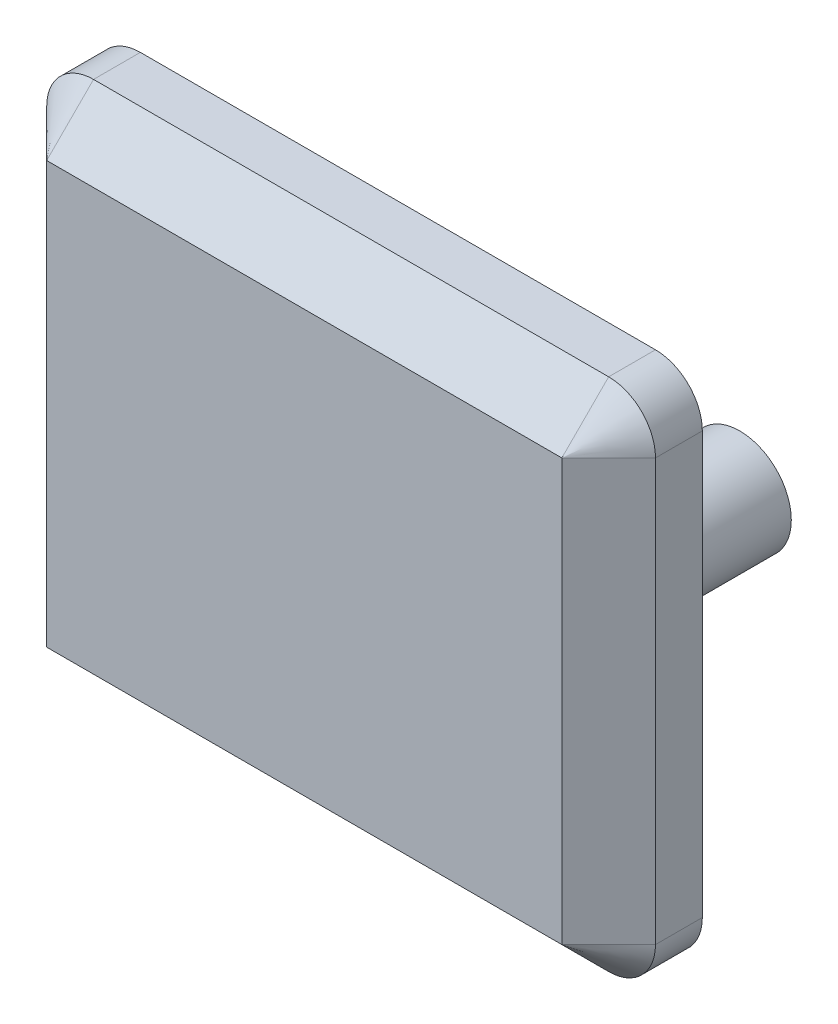
ISO-10303-21;
HEADER;
FILE_DESCRIPTION(('STEP AP214'),'2;1');
FILE_NAME('part.step','',(''),(''),'','','');
FILE_SCHEMA(('AUTOMOTIVE_DESIGN { 1 0 10303 214 1 1 1 1 }'));
ENDSEC;
DATA;
#1=APPLICATION_CONTEXT('core data for automotive mechanical design processes');
#2=APPLICATION_PROTOCOL_DEFINITION('international standard','automotive_design',2000,#1);
#3=PRODUCT_CONTEXT('',#1,'mechanical');
#4=PRODUCT('Part','Part','',(#3));
#5=PRODUCT_RELATED_PRODUCT_CATEGORY('part','',(#4));
#6=PRODUCT_DEFINITION_FORMATION('','',#4);
#7=PRODUCT_DEFINITION_CONTEXT('part definition',#1,'design');
#8=PRODUCT_DEFINITION('design','',#6,#7);
#9=PRODUCT_DEFINITION_SHAPE('','',#8);
#10=(LENGTH_UNIT() NAMED_UNIT(*) SI_UNIT(.MILLI.,.METRE.));
#11=(NAMED_UNIT(*) PLANE_ANGLE_UNIT() SI_UNIT($,.RADIAN.));
#12=(NAMED_UNIT(*) SI_UNIT($,.STERADIAN.) SOLID_ANGLE_UNIT());
#13=UNCERTAINTY_MEASURE_WITH_UNIT(LENGTH_MEASURE(1.E-05),#10,'distance_accuracy_value','');
#14=(GEOMETRIC_REPRESENTATION_CONTEXT(3) GLOBAL_UNCERTAINTY_ASSIGNED_CONTEXT((#13)) GLOBAL_UNIT_ASSIGNED_CONTEXT((#10,
#11,#12)) REPRESENTATION_CONTEXT('',''));
#15=CARTESIAN_POINT('',(0.,0.,0.));
#16=DIRECTION('',(0.,0.,1.));
#17=DIRECTION('',(1.,0.,0.));
#18=AXIS2_PLACEMENT_3D('',#15,#16,#17);
#19=CARTESIAN_POINT('',(-7.23762279861069,9.5943839209969,1.));
#20=DIRECTION('',(0.,0.,-1.));
#21=DIRECTION('',(-1.,0.,0.));
#22=AXIS2_PLACEMENT_3D('',#19,#20,#21);
#23=CYLINDRICAL_SURFACE('',#22,0.5);
#24=DIRECTION('',(0.,0.,-1.));
#25=VECTOR('',#24,1.);
#26=CARTESIAN_POINT('',(-7.2376227986107,10.0943839209969,1.));
#27=LINE('',#26,#25);
#28=CARTESIAN_POINT('',(-7.2376227986107,10.0943839209969,0.499999999999997));
#29=VERTEX_POINT('',#28);
#30=CARTESIAN_POINT('',(-7.2376227986107,10.0943839209969,0.));
#31=VERTEX_POINT('',#30);
#32=EDGE_CURVE('E120',#29,#31,#27,.T.);
#33=ORIENTED_EDGE('',*,*,#32,.F.);
#34=CARTESIAN_POINT('',(-7.23762279861069,9.5943839209969,0.499999999999997));
#35=DIRECTION('',(0.,0.,1.));
#36=DIRECTION('',(1.,0.,0.));
#37=AXIS2_PLACEMENT_3D('',#34,#35,#36);
#38=CIRCLE('',#37,0.5);
#39=CARTESIAN_POINT('',(-6.73762279861069,9.5943839209969,0.499999999999997));
#40=VERTEX_POINT('',#39);
#41=EDGE_CURVE('E192',#29,#40,#38,.F.);
#42=ORIENTED_EDGE('',*,*,#41,.T.);
#43=DIRECTION('',(0.,0.,-1.));
#44=VECTOR('',#43,1.);
#45=CARTESIAN_POINT('',(-6.73762279861069,9.5943839209969,1.));
#46=LINE('',#45,#44);
#47=CARTESIAN_POINT('',(-6.73762279861069,9.5943839209969,0.));
#48=VERTEX_POINT('',#47);
#49=EDGE_CURVE('E143',#40,#48,#46,.T.);
#50=ORIENTED_EDGE('',*,*,#49,.T.);
#51=CARTESIAN_POINT('',(-7.23762279861069,9.5943839209969,0.));
#52=DIRECTION('',(0.,0.,1.));
#53=DIRECTION('',(1.,0.,0.));
#54=AXIS2_PLACEMENT_3D('',#51,#52,#53);
#55=CIRCLE('',#54,0.5);
#56=EDGE_CURVE('E137',#48,#31,#55,.T.);
#57=ORIENTED_EDGE('',*,*,#56,.T.);
#58=EDGE_LOOP('',(#33,#42,#50,#57));
#59=FACE_BOUND('',#58,.T.);
#60=ADVANCED_FACE('F40',(#59),#23,.T.);
#61=CARTESIAN_POINT('',(-7.2376227986107,10.0943839209969,1.));
#62=DIRECTION('',(0.,-1.,0.));
#63=DIRECTION('',(1.,0.,0.));
#64=AXIS2_PLACEMENT_3D('',#61,#62,#63);
#65=PLANE('',#64);
#66=DIRECTION('',(0.,0.,-1.));
#67=VECTOR('',#66,1.);
#68=CARTESIAN_POINT('',(-12.7376227986107,10.0943839209969,1.));
#69=LINE('',#68,#67);
#70=CARTESIAN_POINT('',(-12.7376227986107,10.0943839209969,0.499999999999997));
#71=VERTEX_POINT('',#70);
#72=CARTESIAN_POINT('',(-12.7376227986107,10.0943839209969,0.));
#73=VERTEX_POINT('',#72);
#74=EDGE_CURVE('E131',#71,#73,#69,.T.);
#75=ORIENTED_EDGE('',*,*,#74,.F.);
#76=DIRECTION('',(1.,0.,0.));
#77=VECTOR('',#76,1.);
#78=CARTESIAN_POINT('',(-7.2376227986107,10.0943839209969,0.499999999999997));
#79=LINE('',#78,#77);
#80=EDGE_CURVE('E127',#71,#29,#79,.T.);
#81=ORIENTED_EDGE('',*,*,#80,.T.);
#82=ORIENTED_EDGE('',*,*,#32,.T.);
#83=DIRECTION('',(-1.,0.,0.));
#84=VECTOR('',#83,1.);
#85=CARTESIAN_POINT('',(-7.2376227986107,10.0943839209969,0.));
#86=LINE('',#85,#84);
#87=EDGE_CURVE('E124',#31,#73,#86,.T.);
#88=ORIENTED_EDGE('',*,*,#87,.T.);
#89=EDGE_LOOP('',(#75,#81,#82,#88));
#90=FACE_BOUND('',#89,.T.);
#91=ADVANCED_FACE('F123',(#90),#65,.F.);
#92=CARTESIAN_POINT('',(-12.7376227986107,9.5943839209969,1.));
#93=DIRECTION('',(0.,0.,-1.));
#94=DIRECTION('',(-1.,0.,0.));
#95=AXIS2_PLACEMENT_3D('',#92,#93,#94);
#96=CYLINDRICAL_SURFACE('',#95,0.5);
#97=DIRECTION('',(0.,0.,-1.));
#98=VECTOR('',#97,1.);
#99=CARTESIAN_POINT('',(-13.2376227986107,9.5943839209969,1.));
#100=LINE('',#99,#98);
#101=CARTESIAN_POINT('',(-13.2376227986107,9.5943839209969,0.499999999999997));
#102=VERTEX_POINT('',#101);
#103=CARTESIAN_POINT('',(-13.2376227986107,9.5943839209969,0.));
#104=VERTEX_POINT('',#103);
#105=EDGE_CURVE('E178',#102,#104,#100,.T.);
#106=ORIENTED_EDGE('',*,*,#105,.F.);
#107=CARTESIAN_POINT('',(-12.7376227986107,9.5943839209969,0.499999999999997));
#108=DIRECTION('',(0.,0.,1.));
#109=DIRECTION('',(1.,0.,0.));
#110=AXIS2_PLACEMENT_3D('',#107,#108,#109);
#111=CIRCLE('',#110,0.5);
#112=EDGE_CURVE('E190',#102,#71,#111,.F.);
#113=ORIENTED_EDGE('',*,*,#112,.T.);
#114=ORIENTED_EDGE('',*,*,#74,.T.);
#115=CARTESIAN_POINT('',(-12.7376227986107,9.5943839209969,0.));
#116=DIRECTION('',(0.,0.,1.));
#117=DIRECTION('',(1.,0.,0.));
#118=AXIS2_PLACEMENT_3D('',#115,#116,#117);
#119=CIRCLE('',#118,0.5);
#120=EDGE_CURVE('E140',#73,#104,#119,.T.);
#121=ORIENTED_EDGE('',*,*,#120,.T.);
#122=EDGE_LOOP('',(#106,#113,#114,#121));
#123=FACE_BOUND('',#122,.T.);
#124=ADVANCED_FACE('F244',(#123),#96,.T.);
#125=CARTESIAN_POINT('',(-13.2376227986107,5.09438392099691,1.));
#126=DIRECTION('',(1.,0.,0.));
#127=DIRECTION('',(0.,0.,-1.));
#128=AXIS2_PLACEMENT_3D('',#125,#126,#127);
#129=PLANE('',#128);
#130=DIRECTION('',(0.,0.,-1.));
#131=VECTOR('',#130,1.);
#132=CARTESIAN_POINT('',(-13.2376227986107,5.0943839209969,1.));
#133=LINE('',#132,#131);
#134=CARTESIAN_POINT('',(-13.2376227986107,5.0943839209969,0.499999999999997));
#135=VERTEX_POINT('',#134);
#136=CARTESIAN_POINT('',(-13.2376227986107,5.0943839209969,0.));
#137=VERTEX_POINT('',#136);
#138=EDGE_CURVE('E176',#135,#137,#133,.T.);
#139=ORIENTED_EDGE('',*,*,#138,.F.);
#140=DIRECTION('',(0.,1.,0.));
#141=VECTOR('',#140,1.);
#142=CARTESIAN_POINT('',(-13.2376227986107,9.5943839209969,0.499999999999997));
#143=LINE('',#142,#141);
#144=EDGE_CURVE('E194',#135,#102,#143,.T.);
#145=ORIENTED_EDGE('',*,*,#144,.T.);
#146=ORIENTED_EDGE('',*,*,#105,.T.);
#147=DIRECTION('',(0.,-1.,0.));
#148=VECTOR('',#147,1.);
#149=CARTESIAN_POINT('',(-13.2376227986107,5.09438392099691,0.));
#150=LINE('',#149,#148);
#151=EDGE_CURVE('E155',#104,#137,#150,.T.);
#152=ORIENTED_EDGE('',*,*,#151,.T.);
#153=EDGE_LOOP('',(#139,#145,#146,#152));
#154=FACE_BOUND('',#153,.T.);
#155=ADVANCED_FACE('F308',(#154),#129,.F.);
#156=CARTESIAN_POINT('',(-12.7376227986107,5.0943839209969,1.));
#157=DIRECTION('',(0.,0.,-1.));
#158=DIRECTION('',(-1.,0.,0.));
#159=AXIS2_PLACEMENT_3D('',#156,#157,#158);
#160=CYLINDRICAL_SURFACE('',#159,0.5);
#161=DIRECTION('',(0.,0.,-1.));
#162=VECTOR('',#161,1.);
#163=CARTESIAN_POINT('',(-12.7376227986107,4.5943839209969,1.));
#164=LINE('',#163,#162);
#165=CARTESIAN_POINT('',(-12.7376227986107,4.5943839209969,0.499999999999997));
#166=VERTEX_POINT('',#165);
#167=CARTESIAN_POINT('',(-12.7376227986107,4.5943839209969,0.));
#168=VERTEX_POINT('',#167);
#169=EDGE_CURVE('E174',#166,#168,#164,.T.);
#170=ORIENTED_EDGE('',*,*,#169,.F.);
#171=CARTESIAN_POINT('',(-12.7376227986107,5.0943839209969,0.499999999999997));
#172=DIRECTION('',(0.,0.,1.));
#173=DIRECTION('',(1.,0.,0.));
#174=AXIS2_PLACEMENT_3D('',#171,#172,#173);
#175=CIRCLE('',#174,0.5);
#176=EDGE_CURVE('E198',#166,#135,#175,.F.);
#177=ORIENTED_EDGE('',*,*,#176,.T.);
#178=ORIENTED_EDGE('',*,*,#138,.T.);
#179=CARTESIAN_POINT('',(-12.7376227986107,5.0943839209969,0.));
#180=DIRECTION('',(0.,0.,1.));
#181=DIRECTION('',(-1.,0.,0.));
#182=AXIS2_PLACEMENT_3D('',#179,#180,#181);
#183=CIRCLE('',#182,0.5);
#184=EDGE_CURVE('E158',#137,#168,#183,.T.);
#185=ORIENTED_EDGE('',*,*,#184,.T.);
#186=EDGE_LOOP('',(#170,#177,#178,#185));
#187=FACE_BOUND('',#186,.T.);
#188=ADVANCED_FACE('F306',(#187),#160,.T.);
#189=CARTESIAN_POINT('',(-7.2376227986107,4.5943839209969,1.));
#190=DIRECTION('',(0.,1.,0.));
#191=DIRECTION('',(0.,0.,1.));
#192=AXIS2_PLACEMENT_3D('',#189,#190,#191);
#193=PLANE('',#192);
#194=DIRECTION('',(0.,0.,-1.));
#195=VECTOR('',#194,1.);
#196=CARTESIAN_POINT('',(-7.2376227986107,4.5943839209969,1.));
#197=LINE('',#196,#195);
#198=CARTESIAN_POINT('',(-7.2376227986107,4.5943839209969,0.499999999999997));
#199=VERTEX_POINT('',#198);
#200=CARTESIAN_POINT('',(-7.2376227986107,4.5943839209969,0.));
#201=VERTEX_POINT('',#200);
#202=EDGE_CURVE('E172',#199,#201,#197,.T.);
#203=ORIENTED_EDGE('',*,*,#202,.F.);
#204=DIRECTION('',(-1.,0.,0.));
#205=VECTOR('',#204,1.);
#206=CARTESIAN_POINT('',(-12.7376227986107,4.5943839209969,0.499999999999997));
#207=LINE('',#206,#205);
#208=EDGE_CURVE('E63',#199,#166,#207,.T.);
#209=ORIENTED_EDGE('',*,*,#208,.T.);
#210=ORIENTED_EDGE('',*,*,#169,.T.);
#211=DIRECTION('',(1.,0.,0.));
#212=VECTOR('',#211,1.);
#213=CARTESIAN_POINT('',(-7.2376227986107,4.5943839209969,0.));
#214=LINE('',#213,#212);
#215=EDGE_CURVE('E161',#168,#201,#214,.T.);
#216=ORIENTED_EDGE('',*,*,#215,.T.);
#217=EDGE_LOOP('',(#203,#209,#210,#216));
#218=FACE_BOUND('',#217,.T.);
#219=ADVANCED_FACE('F313',(#218),#193,.F.);
#220=CARTESIAN_POINT('',(-7.23762279861069,5.0943839209969,1.));
#221=DIRECTION('',(0.,0.,-1.));
#222=DIRECTION('',(-1.,0.,0.));
#223=AXIS2_PLACEMENT_3D('',#220,#221,#222);
#224=CYLINDRICAL_SURFACE('',#223,0.5);
#225=DIRECTION('',(0.,0.,-1.));
#226=VECTOR('',#225,1.);
#227=CARTESIAN_POINT('',(-6.73762279861069,5.09438392099691,1.));
#228=LINE('',#227,#226);
#229=CARTESIAN_POINT('',(-6.73762279861069,5.09438392099691,0.499999999999997));
#230=VERTEX_POINT('',#229);
#231=CARTESIAN_POINT('',(-6.73762279861069,5.09438392099691,0.));
#232=VERTEX_POINT('',#231);
#233=EDGE_CURVE('E170',#230,#232,#228,.T.);
#234=ORIENTED_EDGE('',*,*,#233,.F.);
#235=CARTESIAN_POINT('',(-7.23762279861069,5.0943839209969,0.499999999999997));
#236=DIRECTION('',(0.,0.,1.));
#237=DIRECTION('',(1.,0.,0.));
#238=AXIS2_PLACEMENT_3D('',#235,#236,#237);
#239=CIRCLE('',#238,0.5);
#240=EDGE_CURVE('E56',#230,#199,#239,.F.);
#241=ORIENTED_EDGE('',*,*,#240,.T.);
#242=ORIENTED_EDGE('',*,*,#202,.T.);
#243=CARTESIAN_POINT('',(-7.23762279861069,5.0943839209969,0.));
#244=DIRECTION('',(0.,0.,1.));
#245=DIRECTION('',(1.,0.,0.));
#246=AXIS2_PLACEMENT_3D('',#243,#244,#245);
#247=CIRCLE('',#246,0.5);
#248=EDGE_CURVE('E164',#201,#232,#247,.T.);
#249=ORIENTED_EDGE('',*,*,#248,.T.);
#250=EDGE_LOOP('',(#234,#241,#242,#249));
#251=FACE_BOUND('',#250,.T.);
#252=ADVANCED_FACE('F314',(#251),#224,.T.);
#253=CARTESIAN_POINT('',(-6.73762279861069,5.09438392099691,1.));
#254=DIRECTION('',(-1.,0.,0.));
#255=DIRECTION('',(0.,0.,1.));
#256=AXIS2_PLACEMENT_3D('',#253,#254,#255);
#257=PLANE('',#256);
#258=ORIENTED_EDGE('',*,*,#49,.F.);
#259=DIRECTION('',(0.,-1.,0.));
#260=VECTOR('',#259,1.);
#261=CARTESIAN_POINT('',(-6.73762279861069,5.09438392099691,0.499999999999997));
#262=LINE('',#261,#260);
#263=EDGE_CURVE('E196',#40,#230,#262,.T.);
#264=ORIENTED_EDGE('',*,*,#263,.T.);
#265=ORIENTED_EDGE('',*,*,#233,.T.);
#266=DIRECTION('',(0.,1.,0.));
#267=VECTOR('',#266,1.);
#268=CARTESIAN_POINT('',(-6.73762279861069,5.09438392099691,0.));
#269=LINE('',#268,#267);
#270=EDGE_CURVE('E167',#232,#48,#269,.T.);
#271=ORIENTED_EDGE('',*,*,#270,.T.);
#272=EDGE_LOOP('',(#258,#264,#265,#271));
#273=FACE_BOUND('',#272,.T.);
#274=ADVANCED_FACE('F234',(#273),#257,.F.);
#275=CARTESIAN_POINT('',(-7.23762279861069,9.5943839209969,1.));
#276=DIRECTION('',(0.,0.,1.));
#277=DIRECTION('',(1.,0.,0.));
#278=AXIS2_PLACEMENT_3D('',#275,#276,#277);
#279=PLANE('',#278);
#280=DIRECTION('',(0.,1.,0.));
#281=VECTOR('',#280,1.);
#282=CARTESIAN_POINT('',(-7.2376227986107,9.5943839209969,1.));
#283=LINE('',#282,#281);
#284=CARTESIAN_POINT('',(-7.23762279861069,5.0943839209969,1.));
#285=VERTEX_POINT('',#284);
#286=CARTESIAN_POINT('',(-7.2376227986107,9.5943839209969,1.));
#287=VERTEX_POINT('',#286);
#288=EDGE_CURVE('E182',#285,#287,#283,.T.);
#289=ORIENTED_EDGE('',*,*,#288,.T.);
#290=DIRECTION('',(-1.,0.,0.));
#291=VECTOR('',#290,1.);
#292=CARTESIAN_POINT('',(-12.7376227986107,9.5943839209969,1.));
#293=LINE('',#292,#291);
#294=CARTESIAN_POINT('',(-12.7376227986107,9.5943839209969,1.));
#295=VERTEX_POINT('',#294);
#296=EDGE_CURVE('E186',#287,#295,#293,.T.);
#297=ORIENTED_EDGE('',*,*,#296,.T.);
#298=DIRECTION('',(0.,-1.,0.));
#299=VECTOR('',#298,1.);
#300=CARTESIAN_POINT('',(-12.7376227986107,5.0943839209969,1.));
#301=LINE('',#300,#299);
#302=CARTESIAN_POINT('',(-12.7376227986107,5.0943839209969,1.));
#303=VERTEX_POINT('',#302);
#304=EDGE_CURVE('E184',#295,#303,#301,.T.);
#305=ORIENTED_EDGE('',*,*,#304,.T.);
#306=DIRECTION('',(1.,0.,0.));
#307=VECTOR('',#306,1.);
#308=CARTESIAN_POINT('',(-7.2376227986107,5.0943839209969,1.));
#309=LINE('',#308,#307);
#310=EDGE_CURVE('E130',#303,#285,#309,.T.);
#311=ORIENTED_EDGE('',*,*,#310,.T.);
#312=EDGE_LOOP('',(#289,#297,#305,#311));
#313=FACE_BOUND('',#312,.T.);
#314=ADVANCED_FACE('F225',(#313),#279,.T.);
#315=CARTESIAN_POINT('',(-7.23762279861069,9.5943839209969,0.));
#316=DIRECTION('',(0.,0.,1.));
#317=DIRECTION('',(1.,0.,0.));
#318=AXIS2_PLACEMENT_3D('',#315,#316,#317);
#319=PLANE('',#318);
#320=CARTESIAN_POINT('',(-8.2376227986107,7.3443839209969,0.));
#321=DIRECTION('',(0.,0.,1.));
#322=DIRECTION('',(1.,0.,0.));
#323=AXIS2_PLACEMENT_3D('',#320,#321,#322);
#324=CIRCLE('',#323,0.55);
#325=CARTESIAN_POINT('',(-7.6876227986107,7.3443839209969,0.));
#326=VERTEX_POINT('',#325);
#327=EDGE_CURVE('E11',#326,#326,#324,.F.);
#328=ORIENTED_EDGE('',*,*,#327,.F.);
#329=EDGE_LOOP('',(#328));
#330=FACE_BOUND('',#329,.T.);
#331=CARTESIAN_POINT('',(-11.7376227986107,7.34438392099691,0.));
#332=DIRECTION('',(0.,0.,1.));
#333=DIRECTION('',(1.,0.,0.));
#334=AXIS2_PLACEMENT_3D('',#331,#332,#333);
#335=CIRCLE('',#334,0.55);
#336=CARTESIAN_POINT('',(-11.1876227986107,7.34438392099691,0.));
#337=VERTEX_POINT('',#336);
#338=EDGE_CURVE('E49',#337,#337,#335,.F.);
#339=ORIENTED_EDGE('',*,*,#338,.F.);
#340=EDGE_LOOP('',(#339));
#341=FACE_BOUND('',#340,.T.);
#342=ORIENTED_EDGE('',*,*,#56,.F.);
#343=ORIENTED_EDGE('',*,*,#270,.F.);
#344=ORIENTED_EDGE('',*,*,#248,.F.);
#345=ORIENTED_EDGE('',*,*,#215,.F.);
#346=ORIENTED_EDGE('',*,*,#184,.F.);
#347=ORIENTED_EDGE('',*,*,#151,.F.);
#348=ORIENTED_EDGE('',*,*,#120,.F.);
#349=ORIENTED_EDGE('',*,*,#87,.F.);
#350=EDGE_LOOP('',(#342,#343,#344,#345,#346,#347,#348,#349));
#351=FACE_BOUND('',#350,.T.);
#352=ADVANCED_FACE('F135',(#330,#341,#351),#319,.F.);
#353=CARTESIAN_POINT('',(-7.23762279861069,5.0943839209969,1.));
#354=DIRECTION('',(0.,-0.707106781186549,0.707106781186546));
#355=DIRECTION('',(-1.,0.,0.));
#356=AXIS2_PLACEMENT_3D('',#353,#354,#355);
#357=PLANE('',#356);
#358=DIRECTION('',(0.,0.707106781186546,0.707106781186549));
#359=VECTOR('',#358,1.);
#360=CARTESIAN_POINT('',(-12.7376227986107,4.5943839209969,0.499999999999997));
#361=LINE('',#360,#359);
#362=EDGE_CURVE('E148',#166,#303,#361,.T.);
#363=ORIENTED_EDGE('',*,*,#362,.F.);
#364=ORIENTED_EDGE('',*,*,#208,.F.);
#365=DIRECTION('',(0.,-0.707106781186546,-0.707106781186549));
#366=VECTOR('',#365,1.);
#367=CARTESIAN_POINT('',(-7.23762279861069,5.0943839209969,1.));
#368=LINE('',#367,#366);
#369=EDGE_CURVE('E145',#285,#199,#368,.T.);
#370=ORIENTED_EDGE('',*,*,#369,.F.);
#371=ORIENTED_EDGE('',*,*,#310,.F.);
#372=EDGE_LOOP('',(#363,#364,#370,#371));
#373=FACE_BOUND('',#372,.T.);
#374=ADVANCED_FACE('F43',(#373),#357,.T.);
#375=CARTESIAN_POINT('',(-7.23762279861069,5.0943839209969,0.499999999999997));
#376=DIRECTION('',(0.,0.,-1.));
#377=DIRECTION('',(-1.,0.,0.));
#378=AXIS2_PLACEMENT_3D('',#375,#376,#377);
#379=CONICAL_SURFACE('',#378,0.5,0.785398163397446);
#380=ORIENTED_EDGE('',*,*,#369,.T.);
#381=ORIENTED_EDGE('',*,*,#240,.F.);
#382=DIRECTION('',(0.707106781186546,0.,-0.707106781186549));
#383=VECTOR('',#382,1.);
#384=CARTESIAN_POINT('',(-7.2376227986107,5.09438392099691,1.));
#385=LINE('',#384,#383);
#386=EDGE_CURVE('E215',#285,#230,#385,.T.);
#387=ORIENTED_EDGE('',*,*,#386,.F.);
#388=EDGE_LOOP('',(#380,#381,#387));
#389=FACE_BOUND('',#388,.T.);
#390=ADVANCED_FACE('F232',(#389),#379,.T.);
#391=CARTESIAN_POINT('',(-12.7376227986107,5.0943839209969,0.499999999999997));
#392=DIRECTION('',(0.,0.,-1.));
#393=DIRECTION('',(-1.,0.,0.));
#394=AXIS2_PLACEMENT_3D('',#391,#392,#393);
#395=CONICAL_SURFACE('',#394,0.5,0.785398163397446);
#396=ORIENTED_EDGE('',*,*,#176,.F.);
#397=ORIENTED_EDGE('',*,*,#362,.T.);
#398=DIRECTION('',(0.707106781186546,0.,0.707106781186549));
#399=VECTOR('',#398,1.);
#400=CARTESIAN_POINT('',(-13.2376227986107,5.0943839209969,0.499999999999997));
#401=LINE('',#400,#399);
#402=EDGE_CURVE('E212',#135,#303,#401,.T.);
#403=ORIENTED_EDGE('',*,*,#402,.F.);
#404=EDGE_LOOP('',(#396,#397,#403));
#405=FACE_BOUND('',#404,.T.);
#406=ADVANCED_FACE('F283',(#405),#395,.T.);
#407=CARTESIAN_POINT('',(-7.2376227986107,9.5943839209969,1.));
#408=DIRECTION('',(0.707106781186549,0.,0.707106781186546));
#409=DIRECTION('',(0.,-1.,0.));
#410=AXIS2_PLACEMENT_3D('',#407,#408,#409);
#411=PLANE('',#410);
#412=ORIENTED_EDGE('',*,*,#386,.T.);
#413=ORIENTED_EDGE('',*,*,#263,.F.);
#414=DIRECTION('',(0.707106781186546,0.,-0.707106781186549));
#415=VECTOR('',#414,1.);
#416=CARTESIAN_POINT('',(-7.2376227986107,9.5943839209969,1.));
#417=LINE('',#416,#415);
#418=EDGE_CURVE('E209',#287,#40,#417,.T.);
#419=ORIENTED_EDGE('',*,*,#418,.F.);
#420=ORIENTED_EDGE('',*,*,#288,.F.);
#421=EDGE_LOOP('',(#412,#413,#419,#420));
#422=FACE_BOUND('',#421,.T.);
#423=ADVANCED_FACE('F276',(#422),#411,.T.);
#424=CARTESIAN_POINT('',(-12.7376227986107,9.5943839209969,1.));
#425=DIRECTION('',(-0.707106781186549,0.,0.707106781186546));
#426=DIRECTION('',(0.,1.,0.));
#427=AXIS2_PLACEMENT_3D('',#424,#425,#426);
#428=PLANE('',#427);
#429=ORIENTED_EDGE('',*,*,#402,.T.);
#430=ORIENTED_EDGE('',*,*,#304,.F.);
#431=DIRECTION('',(0.707106781186546,0.,0.707106781186549));
#432=VECTOR('',#431,1.);
#433=CARTESIAN_POINT('',(-13.2376227986107,9.5943839209969,0.499999999999997));
#434=LINE('',#433,#432);
#435=EDGE_CURVE('E206',#102,#295,#434,.T.);
#436=ORIENTED_EDGE('',*,*,#435,.F.);
#437=ORIENTED_EDGE('',*,*,#144,.F.);
#438=EDGE_LOOP('',(#429,#430,#436,#437));
#439=FACE_BOUND('',#438,.T.);
#440=ADVANCED_FACE('F269',(#439),#428,.T.);
#441=CARTESIAN_POINT('',(-7.23762279861069,9.5943839209969,0.499999999999997));
#442=DIRECTION('',(0.,0.,-1.));
#443=DIRECTION('',(-1.,0.,0.));
#444=AXIS2_PLACEMENT_3D('',#441,#442,#443);
#445=CONICAL_SURFACE('',#444,0.5,0.785398163397446);
#446=ORIENTED_EDGE('',*,*,#418,.T.);
#447=ORIENTED_EDGE('',*,*,#41,.F.);
#448=DIRECTION('',(0.,0.707106781186546,-0.707106781186549));
#449=VECTOR('',#448,1.);
#450=CARTESIAN_POINT('',(-7.2376227986107,9.5943839209969,1.));
#451=LINE('',#450,#449);
#452=EDGE_CURVE('E204',#287,#29,#451,.T.);
#453=ORIENTED_EDGE('',*,*,#452,.F.);
#454=EDGE_LOOP('',(#446,#447,#453));
#455=FACE_BOUND('',#454,.T.);
#456=ADVANCED_FACE('F262',(#455),#445,.T.);
#457=CARTESIAN_POINT('',(-12.7376227986107,9.5943839209969,0.499999999999997));
#458=DIRECTION('',(0.,0.,-1.));
#459=DIRECTION('',(-1.,0.,0.));
#460=AXIS2_PLACEMENT_3D('',#457,#458,#459);
#461=CONICAL_SURFACE('',#460,0.5,0.785398163397446);
#462=ORIENTED_EDGE('',*,*,#112,.F.);
#463=ORIENTED_EDGE('',*,*,#435,.T.);
#464=DIRECTION('',(0.,-0.707106781186546,0.707106781186549));
#465=VECTOR('',#464,1.);
#466=CARTESIAN_POINT('',(-12.7376227986107,10.0943839209969,0.499999999999997));
#467=LINE('',#466,#465);
#468=EDGE_CURVE('E202',#71,#295,#467,.T.);
#469=ORIENTED_EDGE('',*,*,#468,.F.);
#470=EDGE_LOOP('',(#462,#463,#469));
#471=FACE_BOUND('',#470,.T.);
#472=ADVANCED_FACE('F255',(#471),#461,.T.);
#473=CARTESIAN_POINT('',(-7.23762279861069,9.5943839209969,1.));
#474=DIRECTION('',(0.,0.707106781186549,0.707106781186546));
#475=DIRECTION('',(1.,0.,0.));
#476=AXIS2_PLACEMENT_3D('',#473,#474,#475);
#477=PLANE('',#476);
#478=ORIENTED_EDGE('',*,*,#452,.T.);
#479=ORIENTED_EDGE('',*,*,#80,.F.);
#480=ORIENTED_EDGE('',*,*,#468,.T.);
#481=ORIENTED_EDGE('',*,*,#296,.F.);
#482=EDGE_LOOP('',(#478,#479,#480,#481));
#483=FACE_BOUND('',#482,.T.);
#484=ADVANCED_FACE('F249',(#483),#477,.T.);
#485=CARTESIAN_POINT('',(-11.7376227986107,7.34438392099691,-1.9));
#486=DIRECTION('',(0.,0.,1.));
#487=DIRECTION('',(1.,0.,0.));
#488=AXIS2_PLACEMENT_3D('',#485,#486,#487);
#489=CYLINDRICAL_SURFACE('',#488,0.55);
#490=CARTESIAN_POINT('',(-11.7376227986107,7.34438392099691,-1.9));
#491=DIRECTION('',(0.,0.,-1.));
#492=DIRECTION('',(-1.,0.,0.));
#493=AXIS2_PLACEMENT_3D('',#490,#491,#492);
#494=CIRCLE('',#493,0.55);
#495=CARTESIAN_POINT('',(-12.2876227986107,7.34438392099691,-1.9));
#496=VERTEX_POINT('',#495);
#497=EDGE_CURVE('E151',#496,#496,#494,.T.);
#498=ORIENTED_EDGE('',*,*,#497,.F.);
#499=EDGE_LOOP('',(#498));
#500=FACE_BOUND('',#499,.T.);
#501=ORIENTED_EDGE('',*,*,#338,.T.);
#502=EDGE_LOOP('',(#501));
#503=FACE_BOUND('',#502,.T.);
#504=ADVANCED_FACE('F222',(#500,#503),#489,.T.);
#505=CARTESIAN_POINT('',(-11.7376227986107,7.34438392099691,-1.9));
#506=DIRECTION('',(0.,0.,-1.));
#507=DIRECTION('',(-1.,0.,0.));
#508=AXIS2_PLACEMENT_3D('',#505,#506,#507);
#509=PLANE('',#508);
#510=ORIENTED_EDGE('',*,*,#497,.T.);
#511=EDGE_LOOP('',(#510));
#512=FACE_BOUND('',#511,.T.);
#513=ADVANCED_FACE('F415',(#512),#509,.T.);
#514=CARTESIAN_POINT('',(-8.2376227986107,7.3443839209969,-1.9));
#515=DIRECTION('',(0.,0.,1.));
#516=DIRECTION('',(1.,0.,0.));
#517=AXIS2_PLACEMENT_3D('',#514,#515,#516);
#518=CYLINDRICAL_SURFACE('',#517,0.55);
#519=CARTESIAN_POINT('',(-8.2376227986107,7.3443839209969,-1.9));
#520=DIRECTION('',(0.,0.,-1.));
#521=DIRECTION('',(-1.,0.,0.));
#522=AXIS2_PLACEMENT_3D('',#519,#520,#521);
#523=CIRCLE('',#522,0.55);
#524=CARTESIAN_POINT('',(-8.78762279861069,7.3443839209969,-1.9));
#525=VERTEX_POINT('',#524);
#526=EDGE_CURVE('E523',#525,#525,#523,.T.);
#527=ORIENTED_EDGE('',*,*,#526,.F.);
#528=EDGE_LOOP('',(#527));
#529=FACE_BOUND('',#528,.T.);
#530=ORIENTED_EDGE('',*,*,#327,.T.);
#531=EDGE_LOOP('',(#530));
#532=FACE_BOUND('',#531,.T.);
#533=ADVANCED_FACE('F426',(#529,#532),#518,.T.);
#534=CARTESIAN_POINT('',(-8.2376227986107,7.3443839209969,-1.9));
#535=DIRECTION('',(0.,0.,-1.));
#536=DIRECTION('',(-1.,0.,0.));
#537=AXIS2_PLACEMENT_3D('',#534,#535,#536);
#538=PLANE('',#537);
#539=ORIENTED_EDGE('',*,*,#526,.T.);
#540=EDGE_LOOP('',(#539));
#541=FACE_BOUND('',#540,.T.);
#542=ADVANCED_FACE('F437',(#541),#538,.T.);
#543=CLOSED_SHELL('',(#60,#91,#124,#155,#188,#219,#252,#274,#314,#352,#374,#390,#406,#423,#440,
#456,#472,#484,#504,#513,#533,#542));
#544=MANIFOLD_SOLID_BREP('B2',#543);
#545=ADVANCED_BREP_SHAPE_REPRESENTATION('',(#18,#544),#14);
#546=SHAPE_DEFINITION_REPRESENTATION(#9,#545);
ENDSEC;
END-ISO-10303-21;
